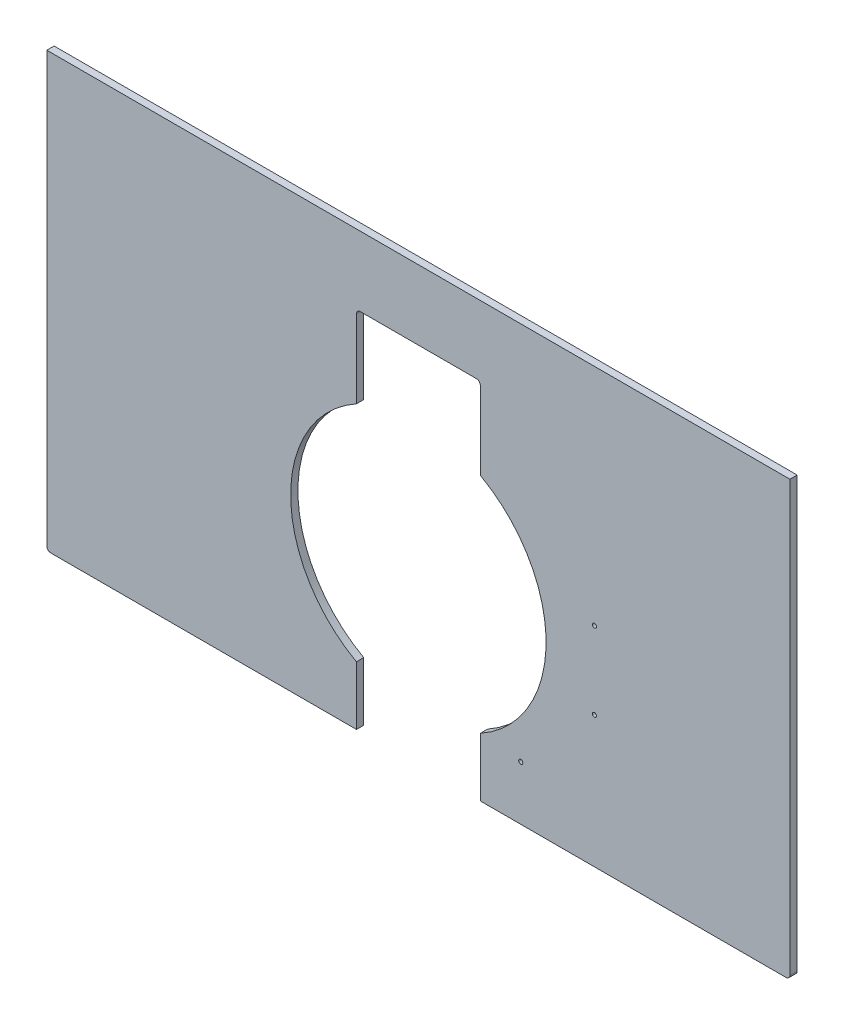
ISO-10303-21;
HEADER;
FILE_DESCRIPTION(('STEP AP214'),'2;1');
FILE_NAME('part.step','',(''),(''),'','','');
FILE_SCHEMA(('AUTOMOTIVE_DESIGN { 1 0 10303 214 1 1 1 1 }'));
ENDSEC;
DATA;
#1=APPLICATION_CONTEXT('core data for automotive mechanical design processes');
#2=APPLICATION_PROTOCOL_DEFINITION('international standard','automotive_design',2000,#1);
#3=PRODUCT_CONTEXT('',#1,'mechanical');
#4=PRODUCT('Part','Part','',(#3));
#5=PRODUCT_RELATED_PRODUCT_CATEGORY('part','',(#4));
#6=PRODUCT_DEFINITION_FORMATION('','',#4);
#7=PRODUCT_DEFINITION_CONTEXT('part definition',#1,'design');
#8=PRODUCT_DEFINITION('design','',#6,#7);
#9=PRODUCT_DEFINITION_SHAPE('','',#8);
#10=(LENGTH_UNIT() NAMED_UNIT(*) SI_UNIT(.MILLI.,.METRE.));
#11=(NAMED_UNIT(*) PLANE_ANGLE_UNIT() SI_UNIT($,.RADIAN.));
#12=(NAMED_UNIT(*) SI_UNIT($,.STERADIAN.) SOLID_ANGLE_UNIT());
#13=UNCERTAINTY_MEASURE_WITH_UNIT(LENGTH_MEASURE(1.E-05),#10,'distance_accuracy_value','');
#14=(GEOMETRIC_REPRESENTATION_CONTEXT(3) GLOBAL_UNCERTAINTY_ASSIGNED_CONTEXT((#13)) GLOBAL_UNIT_ASSIGNED_CONTEXT((#10,
#11,#12)) REPRESENTATION_CONTEXT('',''));
#15=CARTESIAN_POINT('',(0.,0.,0.));
#16=DIRECTION('',(0.,0.,1.));
#17=DIRECTION('',(1.,0.,0.));
#18=AXIS2_PLACEMENT_3D('',#15,#16,#17);
#19=CARTESIAN_POINT('',(0.,0.,11.90625));
#20=DIRECTION('',(0.,1.,0.));
#21=DIRECTION('',(0.,0.,1.));
#22=AXIS2_PLACEMENT_3D('',#19,#20,#21);
#23=PLANE('',#22);
#24=DIRECTION('',(1.,0.,0.));
#25=VECTOR('',#24,1.);
#26=CARTESIAN_POINT('',(0.,0.,11.90625));
#27=LINE('',#26,#25);
#28=CARTESIAN_POINT('',(6.35,0.,11.90625));
#29=VERTEX_POINT('',#28);
#30=CARTESIAN_POINT('',(508.,0.,11.90625));
#31=VERTEX_POINT('',#30);
#32=EDGE_CURVE('E169',#29,#31,#27,.T.);
#33=ORIENTED_EDGE('',*,*,#32,.F.);
#34=DIRECTION('',(0.,0.,-1.));
#35=VECTOR('',#34,1.);
#36=CARTESIAN_POINT('',(6.35,0.,11.90625));
#37=LINE('',#36,#35);
#38=CARTESIAN_POINT('',(6.35,0.,0.));
#39=VERTEX_POINT('',#38);
#40=EDGE_CURVE('E190',#29,#39,#37,.T.);
#41=ORIENTED_EDGE('',*,*,#40,.T.);
#42=DIRECTION('',(1.,0.,0.));
#43=VECTOR('',#42,1.);
#44=CARTESIAN_POINT('',(0.,0.,0.));
#45=LINE('',#44,#43);
#46=CARTESIAN_POINT('',(508.,0.,0.));
#47=VERTEX_POINT('',#46);
#48=EDGE_CURVE('E173',#39,#47,#45,.T.);
#49=ORIENTED_EDGE('',*,*,#48,.T.);
#50=DIRECTION('',(0.,0.,1.));
#51=VECTOR('',#50,1.);
#52=CARTESIAN_POINT('',(508.,0.,11.90625));
#53=LINE('',#52,#51);
#54=EDGE_CURVE('E260',#47,#31,#53,.T.);
#55=ORIENTED_EDGE('',*,*,#54,.T.);
#56=EDGE_LOOP('',(#33,#41,#49,#55));
#57=FACE_BOUND('',#56,.T.);
#58=ADVANCED_FACE('F35',(#57),#23,.F.);
#59=CARTESIAN_POINT('',(609.6,279.4,0.));
#60=DIRECTION('',(0.,0.,1.));
#61=DIRECTION('',(1.,0.,0.));
#62=AXIS2_PLACEMENT_3D('',#59,#60,#61);
#63=CYLINDRICAL_SURFACE('',#62,209.55);
#64=CARTESIAN_POINT('',(609.6,279.4,11.90625));
#65=DIRECTION('',(0.,0.,1.));
#66=DIRECTION('',(1.,0.,0.));
#67=AXIS2_PLACEMENT_3D('',#64,#65,#66);
#68=CIRCLE('',#67,209.55);
#69=CARTESIAN_POINT('',(508.,462.672045058705,11.90625));
#70=VERTEX_POINT('',#69);
#71=CARTESIAN_POINT('',(508.,96.127954941295,11.90625));
#72=VERTEX_POINT('',#71);
#73=EDGE_CURVE('E268',#70,#72,#68,.T.);
#74=ORIENTED_EDGE('',*,*,#73,.T.);
#75=DIRECTION('',(0.,0.,1.));
#76=VECTOR('',#75,1.);
#77=CARTESIAN_POINT('',(508.,96.127954941295,0.));
#78=LINE('',#77,#76);
#79=CARTESIAN_POINT('',(508.,96.127954941295,0.));
#80=VERTEX_POINT('',#79);
#81=EDGE_CURVE('E187',#72,#80,#78,.F.);
#82=ORIENTED_EDGE('',*,*,#81,.T.);
#83=CARTESIAN_POINT('',(609.6,279.4,0.));
#84=DIRECTION('',(0.,0.,1.));
#85=DIRECTION('',(1.,0.,0.));
#86=AXIS2_PLACEMENT_3D('',#83,#84,#85);
#87=CIRCLE('',#86,209.55);
#88=CARTESIAN_POINT('',(508.,462.672045058705,0.));
#89=VERTEX_POINT('',#88);
#90=EDGE_CURVE('E267',#89,#80,#87,.T.);
#91=ORIENTED_EDGE('',*,*,#90,.F.);
#92=DIRECTION('',(0.,0.,1.));
#93=VECTOR('',#92,1.);
#94=CARTESIAN_POINT('',(508.,462.672045058705,0.));
#95=LINE('',#94,#93);
#96=EDGE_CURVE('E167',#89,#70,#95,.T.);
#97=ORIENTED_EDGE('',*,*,#96,.T.);
#98=EDGE_LOOP('',(#74,#82,#91,#97));
#99=FACE_BOUND('',#98,.T.);
#100=ADVANCED_FACE('F324',(#99),#63,.F.);
#101=CARTESIAN_POINT('',(0.,0.,11.90625));
#102=DIRECTION('',(0.,0.,1.));
#103=DIRECTION('',(1.,0.,0.));
#104=AXIS2_PLACEMENT_3D('',#101,#102,#103);
#105=PLANE('',#104);
#106=DIRECTION('',(1.,0.,0.));
#107=VECTOR('',#106,1.);
#108=CARTESIAN_POINT('',(0.,711.2,11.90625));
#109=LINE('',#108,#107);
#110=CARTESIAN_POINT('',(0.,711.2,11.90625));
#111=VERTEX_POINT('',#110);
#112=CARTESIAN_POINT('',(1219.2,711.2,11.90625));
#113=VERTEX_POINT('',#112);
#114=EDGE_CURVE('E148',#111,#113,#109,.T.);
#115=ORIENTED_EDGE('',*,*,#114,.F.);
#116=DIRECTION('',(0.,-1.,0.));
#117=VECTOR('',#116,1.);
#118=CARTESIAN_POINT('',(0.,0.,11.90625));
#119=LINE('',#118,#117);
#120=CARTESIAN_POINT('',(0.,6.35,11.90625));
#121=VERTEX_POINT('',#120);
#122=EDGE_CURVE('E155',#111,#121,#119,.T.);
#123=ORIENTED_EDGE('',*,*,#122,.T.);
#124=CARTESIAN_POINT('',(6.35,6.35,11.90625));
#125=DIRECTION('',(0.,0.,1.));
#126=DIRECTION('',(1.,0.,0.));
#127=AXIS2_PLACEMENT_3D('',#124,#125,#126);
#128=CIRCLE('',#127,6.35);
#129=EDGE_CURVE('E200',#121,#29,#128,.T.);
#130=ORIENTED_EDGE('',*,*,#129,.T.);
#131=ORIENTED_EDGE('',*,*,#32,.T.);
#132=DIRECTION('',(0.,-1.,0.));
#133=VECTOR('',#132,1.);
#134=CARTESIAN_POINT('',(508.,127.,11.90625));
#135=LINE('',#134,#133);
#136=EDGE_CURVE('E240',#72,#31,#135,.T.);
#137=ORIENTED_EDGE('',*,*,#136,.F.);
#138=ORIENTED_EDGE('',*,*,#73,.F.);
#139=DIRECTION('',(0.,-1.,0.));
#140=VECTOR('',#139,1.);
#141=CARTESIAN_POINT('',(508.,596.9,11.90625));
#142=LINE('',#141,#140);
#143=CARTESIAN_POINT('',(508.,590.55,11.90625));
#144=VERTEX_POINT('',#143);
#145=EDGE_CURVE('E250',#144,#70,#142,.T.);
#146=ORIENTED_EDGE('',*,*,#145,.F.);
#147=CARTESIAN_POINT('',(514.35,590.55,11.90625));
#148=DIRECTION('',(0.,0.,1.));
#149=DIRECTION('',(1.,0.,0.));
#150=AXIS2_PLACEMENT_3D('',#147,#148,#149);
#151=CIRCLE('',#150,6.35);
#152=CARTESIAN_POINT('',(514.35,596.9,11.90625));
#153=VERTEX_POINT('',#152);
#154=EDGE_CURVE('E217',#144,#153,#151,.F.);
#155=ORIENTED_EDGE('',*,*,#154,.T.);
#156=DIRECTION('',(-1.,0.,0.));
#157=VECTOR('',#156,1.);
#158=CARTESIAN_POINT('',(508.,596.9,11.90625));
#159=LINE('',#158,#157);
#160=CARTESIAN_POINT('',(704.85,596.9,11.90625));
#161=VERTEX_POINT('',#160);
#162=EDGE_CURVE('E247',#161,#153,#159,.T.);
#163=ORIENTED_EDGE('',*,*,#162,.F.);
#164=CARTESIAN_POINT('',(704.85,590.55,11.90625));
#165=DIRECTION('',(0.,0.,1.));
#166=DIRECTION('',(1.,0.,0.));
#167=AXIS2_PLACEMENT_3D('',#164,#165,#166);
#168=CIRCLE('',#167,6.35);
#169=CARTESIAN_POINT('',(711.2,590.55,11.90625));
#170=VERTEX_POINT('',#169);
#171=EDGE_CURVE('E221',#161,#170,#168,.F.);
#172=ORIENTED_EDGE('',*,*,#171,.T.);
#173=DIRECTION('',(0.,1.,0.));
#174=VECTOR('',#173,1.);
#175=CARTESIAN_POINT('',(711.2,596.9,11.90625));
#176=LINE('',#175,#174);
#177=CARTESIAN_POINT('',(711.2,462.672045058705,11.90625));
#178=VERTEX_POINT('',#177);
#179=EDGE_CURVE('E245',#178,#170,#176,.T.);
#180=ORIENTED_EDGE('',*,*,#179,.F.);
#181=CARTESIAN_POINT('',(711.2,96.1279549412949,11.90625));
#182=VERTEX_POINT('',#181);
#183=EDGE_CURVE('E264',#182,#178,#68,.T.);
#184=ORIENTED_EDGE('',*,*,#183,.F.);
#185=DIRECTION('',(0.,1.,0.));
#186=VECTOR('',#185,1.);
#187=CARTESIAN_POINT('',(711.2,127.,11.90625));
#188=LINE('',#187,#186);
#189=CARTESIAN_POINT('',(711.2,0.,11.90625));
#190=VERTEX_POINT('',#189);
#191=EDGE_CURVE('E274',#190,#182,#188,.T.);
#192=ORIENTED_EDGE('',*,*,#191,.F.);
#193=CARTESIAN_POINT('',(1212.85,0.,11.90625));
#194=VERTEX_POINT('',#193);
#195=EDGE_CURVE('E180',#190,#194,#27,.T.);
#196=ORIENTED_EDGE('',*,*,#195,.T.);
#197=CARTESIAN_POINT('',(1212.85,6.35,11.90625));
#198=DIRECTION('',(0.,0.,1.));
#199=DIRECTION('',(1.,0.,0.));
#200=AXIS2_PLACEMENT_3D('',#197,#198,#199);
#201=CIRCLE('',#200,6.35);
#202=CARTESIAN_POINT('',(1219.2,6.35,11.90625));
#203=VERTEX_POINT('',#202);
#204=EDGE_CURVE('E57',#194,#203,#201,.T.);
#205=ORIENTED_EDGE('',*,*,#204,.T.);
#206=DIRECTION('',(0.,1.,0.));
#207=VECTOR('',#206,1.);
#208=CARTESIAN_POINT('',(1219.2,0.,11.90625));
#209=LINE('',#208,#207);
#210=EDGE_CURVE('E157',#203,#113,#209,.T.);
#211=ORIENTED_EDGE('',*,*,#210,.T.);
#212=EDGE_LOOP('',(#115,#123,#130,#131,#137,#138,#146,#155,#163,#172,#180,#184,#192,#196,#205,#211));
#213=FACE_BOUND('',#212,.T.);
#214=CARTESIAN_POINT('',(898.525,342.9,11.90625));
#215=DIRECTION('',(0.,0.,1.));
#216=DIRECTION('',(1.,0.,0.));
#217=AXIS2_PLACEMENT_3D('',#214,#215,#216);
#218=CIRCLE('',#217,3.37819999999999);
#219=CARTESIAN_POINT('',(901.9032,342.9,11.90625));
#220=VERTEX_POINT('',#219);
#221=EDGE_CURVE('E294',#220,#220,#218,.T.);
#222=ORIENTED_EDGE('',*,*,#221,.F.);
#223=EDGE_LOOP('',(#222));
#224=FACE_BOUND('',#223,.T.);
#225=CARTESIAN_POINT('',(898.525,215.9,11.90625));
#226=DIRECTION('',(0.,0.,1.));
#227=DIRECTION('',(1.,0.,0.));
#228=AXIS2_PLACEMENT_3D('',#225,#226,#227);
#229=CIRCLE('',#228,3.37819999999999);
#230=CARTESIAN_POINT('',(901.9032,215.9,11.90625));
#231=VERTEX_POINT('',#230);
#232=EDGE_CURVE('E297',#231,#231,#229,.T.);
#233=ORIENTED_EDGE('',*,*,#232,.F.);
#234=EDGE_LOOP('',(#233));
#235=FACE_BOUND('',#234,.T.);
#236=CARTESIAN_POINT('',(777.605208252602,88.9,11.90625));
#237=DIRECTION('',(0.,0.,1.));
#238=DIRECTION('',(1.,0.,0.));
#239=AXIS2_PLACEMENT_3D('',#236,#237,#238);
#240=CIRCLE('',#239,3.37819999999999);
#241=CARTESIAN_POINT('',(780.983408252602,88.9,11.90625));
#242=VERTEX_POINT('',#241);
#243=EDGE_CURVE('E288',#242,#242,#240,.T.);
#244=ORIENTED_EDGE('',*,*,#243,.F.);
#245=EDGE_LOOP('',(#244));
#246=FACE_BOUND('',#245,.T.);
#247=ADVANCED_FACE('F153',(#213,#224,#235,#246),#105,.T.);
#248=CARTESIAN_POINT('',(0.,0.,0.));
#249=DIRECTION('',(0.,0.,1.));
#250=DIRECTION('',(1.,0.,0.));
#251=AXIS2_PLACEMENT_3D('',#248,#249,#250);
#252=PLANE('',#251);
#253=CARTESIAN_POINT('',(898.525,342.9,0.));
#254=DIRECTION('',(0.,0.,1.));
#255=DIRECTION('',(1.,0.,0.));
#256=AXIS2_PLACEMENT_3D('',#253,#254,#255);
#257=CIRCLE('',#256,3.37819999999999);
#258=CARTESIAN_POINT('',(901.9032,342.9,0.));
#259=VERTEX_POINT('',#258);
#260=EDGE_CURVE('E254',#259,#259,#257,.T.);
#261=ORIENTED_EDGE('',*,*,#260,.T.);
#262=EDGE_LOOP('',(#261));
#263=FACE_BOUND('',#262,.T.);
#264=CARTESIAN_POINT('',(898.525,215.9,0.));
#265=DIRECTION('',(0.,0.,1.));
#266=DIRECTION('',(1.,0.,0.));
#267=AXIS2_PLACEMENT_3D('',#264,#265,#266);
#268=CIRCLE('',#267,3.37819999999999);
#269=CARTESIAN_POINT('',(901.9032,215.9,0.));
#270=VERTEX_POINT('',#269);
#271=EDGE_CURVE('E300',#270,#270,#268,.T.);
#272=ORIENTED_EDGE('',*,*,#271,.T.);
#273=EDGE_LOOP('',(#272));
#274=FACE_BOUND('',#273,.T.);
#275=CARTESIAN_POINT('',(777.605208252602,88.9,0.));
#276=DIRECTION('',(0.,0.,1.));
#277=DIRECTION('',(1.,0.,0.));
#278=AXIS2_PLACEMENT_3D('',#275,#276,#277);
#279=CIRCLE('',#278,3.37819999999999);
#280=CARTESIAN_POINT('',(780.983408252602,88.9,0.));
#281=VERTEX_POINT('',#280);
#282=EDGE_CURVE('E285',#281,#281,#279,.T.);
#283=ORIENTED_EDGE('',*,*,#282,.T.);
#284=EDGE_LOOP('',(#283));
#285=FACE_BOUND('',#284,.T.);
#286=DIRECTION('',(0.,-1.,0.));
#287=VECTOR('',#286,1.);
#288=CARTESIAN_POINT('',(0.,0.,0.));
#289=LINE('',#288,#287);
#290=CARTESIAN_POINT('',(0.,711.2,0.));
#291=VERTEX_POINT('',#290);
#292=CARTESIAN_POINT('',(0.,6.35,0.));
#293=VERTEX_POINT('',#292);
#294=EDGE_CURVE('E179',#291,#293,#289,.T.);
#295=ORIENTED_EDGE('',*,*,#294,.F.);
#296=DIRECTION('',(1.,0.,0.));
#297=VECTOR('',#296,1.);
#298=CARTESIAN_POINT('',(0.,711.2,0.));
#299=LINE('',#298,#297);
#300=CARTESIAN_POINT('',(1219.2,711.2,0.));
#301=VERTEX_POINT('',#300);
#302=EDGE_CURVE('E50',#291,#301,#299,.T.);
#303=ORIENTED_EDGE('',*,*,#302,.T.);
#304=DIRECTION('',(0.,1.,0.));
#305=VECTOR('',#304,1.);
#306=CARTESIAN_POINT('',(1219.2,0.,0.));
#307=LINE('',#306,#305);
#308=CARTESIAN_POINT('',(1219.2,6.35,0.));
#309=VERTEX_POINT('',#308);
#310=EDGE_CURVE('E175',#309,#301,#307,.T.);
#311=ORIENTED_EDGE('',*,*,#310,.F.);
#312=CARTESIAN_POINT('',(1212.85,6.35,0.));
#313=DIRECTION('',(0.,0.,1.));
#314=DIRECTION('',(1.,0.,0.));
#315=AXIS2_PLACEMENT_3D('',#312,#313,#314);
#316=CIRCLE('',#315,6.35);
#317=CARTESIAN_POINT('',(1212.85,0.,0.));
#318=VERTEX_POINT('',#317);
#319=EDGE_CURVE('E193',#309,#318,#316,.F.);
#320=ORIENTED_EDGE('',*,*,#319,.T.);
#321=CARTESIAN_POINT('',(711.2,0.,0.));
#322=VERTEX_POINT('',#321);
#323=EDGE_CURVE('E176',#322,#318,#45,.T.);
#324=ORIENTED_EDGE('',*,*,#323,.F.);
#325=DIRECTION('',(0.,1.,0.));
#326=VECTOR('',#325,1.);
#327=CARTESIAN_POINT('',(711.2,127.,0.));
#328=LINE('',#327,#326);
#329=CARTESIAN_POINT('',(711.2,96.1279549412949,0.));
#330=VERTEX_POINT('',#329);
#331=EDGE_CURVE('E261',#322,#330,#328,.T.);
#332=ORIENTED_EDGE('',*,*,#331,.T.);
#333=CARTESIAN_POINT('',(711.2,462.672045058705,0.));
#334=VERTEX_POINT('',#333);
#335=EDGE_CURVE('E265',#330,#334,#87,.T.);
#336=ORIENTED_EDGE('',*,*,#335,.T.);
#337=DIRECTION('',(0.,1.,0.));
#338=VECTOR('',#337,1.);
#339=CARTESIAN_POINT('',(711.2,596.9,0.));
#340=LINE('',#339,#338);
#341=CARTESIAN_POINT('',(711.2,590.55,0.));
#342=VERTEX_POINT('',#341);
#343=EDGE_CURVE('E231',#334,#342,#340,.T.);
#344=ORIENTED_EDGE('',*,*,#343,.T.);
#345=CARTESIAN_POINT('',(704.85,590.55,0.));
#346=DIRECTION('',(0.,0.,1.));
#347=DIRECTION('',(1.,0.,0.));
#348=AXIS2_PLACEMENT_3D('',#345,#346,#347);
#349=CIRCLE('',#348,6.35);
#350=CARTESIAN_POINT('',(704.85,596.9,0.));
#351=VERTEX_POINT('',#350);
#352=EDGE_CURVE('E43',#342,#351,#349,.T.);
#353=ORIENTED_EDGE('',*,*,#352,.T.);
#354=DIRECTION('',(-1.,0.,0.));
#355=VECTOR('',#354,1.);
#356=CARTESIAN_POINT('',(508.,596.9,0.));
#357=LINE('',#356,#355);
#358=CARTESIAN_POINT('',(514.35,596.9,0.));
#359=VERTEX_POINT('',#358);
#360=EDGE_CURVE('E228',#351,#359,#357,.T.);
#361=ORIENTED_EDGE('',*,*,#360,.T.);
#362=CARTESIAN_POINT('',(514.35,590.55,0.));
#363=DIRECTION('',(0.,0.,1.));
#364=DIRECTION('',(1.,0.,0.));
#365=AXIS2_PLACEMENT_3D('',#362,#363,#364);
#366=CIRCLE('',#365,6.35);
#367=CARTESIAN_POINT('',(508.,590.55,0.));
#368=VERTEX_POINT('',#367);
#369=EDGE_CURVE('E219',#359,#368,#366,.T.);
#370=ORIENTED_EDGE('',*,*,#369,.T.);
#371=DIRECTION('',(0.,-1.,0.));
#372=VECTOR('',#371,1.);
#373=CARTESIAN_POINT('',(508.,596.9,0.));
#374=LINE('',#373,#372);
#375=EDGE_CURVE('E252',#368,#89,#374,.T.);
#376=ORIENTED_EDGE('',*,*,#375,.T.);
#377=ORIENTED_EDGE('',*,*,#90,.T.);
#378=DIRECTION('',(0.,-1.,0.));
#379=VECTOR('',#378,1.);
#380=CARTESIAN_POINT('',(508.,127.,0.));
#381=LINE('',#380,#379);
#382=EDGE_CURVE('E305',#80,#47,#381,.T.);
#383=ORIENTED_EDGE('',*,*,#382,.T.);
#384=ORIENTED_EDGE('',*,*,#48,.F.);
#385=CARTESIAN_POINT('',(6.35,6.35,0.));
#386=DIRECTION('',(0.,0.,1.));
#387=DIRECTION('',(1.,0.,0.));
#388=AXIS2_PLACEMENT_3D('',#385,#386,#387);
#389=CIRCLE('',#388,6.35);
#390=EDGE_CURVE('E195',#39,#293,#389,.F.);
#391=ORIENTED_EDGE('',*,*,#390,.T.);
#392=EDGE_LOOP('',(#295,#303,#311,#320,#324,#332,#336,#344,#353,#361,#370,#376,#377,#383,#384,#391));
#393=FACE_BOUND('',#392,.T.);
#394=ADVANCED_FACE('F227',(#263,#274,#285,#393),#252,.F.);
#395=ORIENTED_EDGE('',*,*,#323,.T.);
#396=DIRECTION('',(0.,0.,-1.));
#397=VECTOR('',#396,1.);
#398=CARTESIAN_POINT('',(1212.85,0.,11.90625));
#399=LINE('',#398,#397);
#400=EDGE_CURVE('E205',#318,#194,#399,.F.);
#401=ORIENTED_EDGE('',*,*,#400,.T.);
#402=ORIENTED_EDGE('',*,*,#195,.F.);
#403=DIRECTION('',(0.,0.,-1.));
#404=VECTOR('',#403,1.);
#405=CARTESIAN_POINT('',(711.2,0.,11.90625));
#406=LINE('',#405,#404);
#407=EDGE_CURVE('E257',#190,#322,#406,.T.);
#408=ORIENTED_EDGE('',*,*,#407,.T.);
#409=EDGE_LOOP('',(#395,#401,#402,#408));
#410=FACE_BOUND('',#409,.T.);
#411=ADVANCED_FACE('F325',(#410),#23,.F.);
#412=CARTESIAN_POINT('',(1219.2,0.,11.90625));
#413=DIRECTION('',(-1.,0.,0.));
#414=DIRECTION('',(0.,0.,1.));
#415=AXIS2_PLACEMENT_3D('',#412,#413,#414);
#416=PLANE('',#415);
#417=ORIENTED_EDGE('',*,*,#310,.T.);
#418=DIRECTION('',(0.,0.,1.));
#419=VECTOR('',#418,1.);
#420=CARTESIAN_POINT('',(1219.2,711.2,-0.793749999999999));
#421=LINE('',#420,#419);
#422=EDGE_CURVE('E158',#301,#113,#421,.T.);
#423=ORIENTED_EDGE('',*,*,#422,.T.);
#424=ORIENTED_EDGE('',*,*,#210,.F.);
#425=DIRECTION('',(0.,0.,-1.));
#426=VECTOR('',#425,1.);
#427=CARTESIAN_POINT('',(1219.2,6.35,11.90625));
#428=LINE('',#427,#426);
#429=EDGE_CURVE('E202',#203,#309,#428,.T.);
#430=ORIENTED_EDGE('',*,*,#429,.T.);
#431=EDGE_LOOP('',(#417,#423,#424,#430));
#432=FACE_BOUND('',#431,.T.);
#433=ADVANCED_FACE('F282',(#432),#416,.F.);
#434=CARTESIAN_POINT('',(0.,0.,11.90625));
#435=DIRECTION('',(1.,0.,0.));
#436=DIRECTION('',(0.,0.,-1.));
#437=AXIS2_PLACEMENT_3D('',#434,#435,#436);
#438=PLANE('',#437);
#439=ORIENTED_EDGE('',*,*,#122,.F.);
#440=DIRECTION('',(0.,0.,-1.));
#441=VECTOR('',#440,1.);
#442=CARTESIAN_POINT('',(0.,711.2,11.90625));
#443=LINE('',#442,#441);
#444=EDGE_CURVE('E11',#111,#291,#443,.T.);
#445=ORIENTED_EDGE('',*,*,#444,.T.);
#446=ORIENTED_EDGE('',*,*,#294,.T.);
#447=DIRECTION('',(0.,0.,-1.));
#448=VECTOR('',#447,1.);
#449=CARTESIAN_POINT('',(0.,6.35,11.90625));
#450=LINE('',#449,#448);
#451=EDGE_CURVE('E162',#293,#121,#450,.F.);
#452=ORIENTED_EDGE('',*,*,#451,.T.);
#453=EDGE_LOOP('',(#439,#445,#446,#452));
#454=FACE_BOUND('',#453,.T.);
#455=ADVANCED_FACE('F160',(#454),#438,.F.);
#456=ORIENTED_EDGE('',*,*,#335,.F.);
#457=DIRECTION('',(0.,0.,1.));
#458=VECTOR('',#457,1.);
#459=CARTESIAN_POINT('',(711.2,96.1279549412949,0.));
#460=LINE('',#459,#458);
#461=EDGE_CURVE('E184',#330,#182,#460,.T.);
#462=ORIENTED_EDGE('',*,*,#461,.T.);
#463=ORIENTED_EDGE('',*,*,#183,.T.);
#464=DIRECTION('',(0.,0.,1.));
#465=VECTOR('',#464,1.);
#466=CARTESIAN_POINT('',(711.2,462.672045058705,0.));
#467=LINE('',#466,#465);
#468=EDGE_CURVE('E164',#178,#334,#467,.F.);
#469=ORIENTED_EDGE('',*,*,#468,.T.);
#470=EDGE_LOOP('',(#456,#462,#463,#469));
#471=FACE_BOUND('',#470,.T.);
#472=ADVANCED_FACE('F329',(#471),#63,.F.);
#473=CARTESIAN_POINT('',(508.,596.9,0.));
#474=DIRECTION('',(-1.,0.,0.));
#475=DIRECTION('',(0.,0.,1.));
#476=AXIS2_PLACEMENT_3D('',#473,#474,#475);
#477=PLANE('',#476);
#478=ORIENTED_EDGE('',*,*,#375,.F.);
#479=DIRECTION('',(0.,0.,1.));
#480=VECTOR('',#479,1.);
#481=CARTESIAN_POINT('',(508.,590.55,11.90625));
#482=LINE('',#481,#480);
#483=EDGE_CURVE('E207',#368,#144,#482,.T.);
#484=ORIENTED_EDGE('',*,*,#483,.T.);
#485=ORIENTED_EDGE('',*,*,#145,.T.);
#486=ORIENTED_EDGE('',*,*,#96,.F.);
#487=EDGE_LOOP('',(#478,#484,#485,#486));
#488=FACE_BOUND('',#487,.T.);
#489=ADVANCED_FACE('F319',(#488),#477,.F.);
#490=CARTESIAN_POINT('',(711.2,596.9,0.));
#491=DIRECTION('',(1.,0.,0.));
#492=DIRECTION('',(0.,0.,-1.));
#493=AXIS2_PLACEMENT_3D('',#490,#491,#492);
#494=PLANE('',#493);
#495=ORIENTED_EDGE('',*,*,#179,.T.);
#496=DIRECTION('',(0.,0.,1.));
#497=VECTOR('',#496,1.);
#498=CARTESIAN_POINT('',(711.2,590.55,0.));
#499=LINE('',#498,#497);
#500=EDGE_CURVE('E215',#170,#342,#499,.F.);
#501=ORIENTED_EDGE('',*,*,#500,.T.);
#502=ORIENTED_EDGE('',*,*,#343,.F.);
#503=ORIENTED_EDGE('',*,*,#468,.F.);
#504=EDGE_LOOP('',(#495,#501,#502,#503));
#505=FACE_BOUND('',#504,.T.);
#506=ADVANCED_FACE('F249',(#505),#494,.F.);
#507=CARTESIAN_POINT('',(508.,596.9,0.));
#508=DIRECTION('',(0.,1.,0.));
#509=DIRECTION('',(0.,0.,1.));
#510=AXIS2_PLACEMENT_3D('',#507,#508,#509);
#511=PLANE('',#510);
#512=ORIENTED_EDGE('',*,*,#162,.T.);
#513=DIRECTION('',(0.,0.,1.));
#514=VECTOR('',#513,1.);
#515=CARTESIAN_POINT('',(514.35,596.9,0.));
#516=LINE('',#515,#514);
#517=EDGE_CURVE('E213',#153,#359,#516,.F.);
#518=ORIENTED_EDGE('',*,*,#517,.T.);
#519=ORIENTED_EDGE('',*,*,#360,.F.);
#520=DIRECTION('',(0.,0.,1.));
#521=VECTOR('',#520,1.);
#522=CARTESIAN_POINT('',(704.85,596.9,11.90625));
#523=LINE('',#522,#521);
#524=EDGE_CURVE('E210',#351,#161,#523,.T.);
#525=ORIENTED_EDGE('',*,*,#524,.T.);
#526=EDGE_LOOP('',(#512,#518,#519,#525));
#527=FACE_BOUND('',#526,.T.);
#528=ADVANCED_FACE('F237',(#527),#511,.F.);
#529=CARTESIAN_POINT('',(711.2,127.,0.));
#530=DIRECTION('',(1.,0.,0.));
#531=DIRECTION('',(0.,0.,-1.));
#532=AXIS2_PLACEMENT_3D('',#529,#530,#531);
#533=PLANE('',#532);
#534=ORIENTED_EDGE('',*,*,#191,.T.);
#535=ORIENTED_EDGE('',*,*,#461,.F.);
#536=ORIENTED_EDGE('',*,*,#331,.F.);
#537=ORIENTED_EDGE('',*,*,#407,.F.);
#538=EDGE_LOOP('',(#534,#535,#536,#537));
#539=FACE_BOUND('',#538,.T.);
#540=ADVANCED_FACE('F330',(#539),#533,.F.);
#541=CARTESIAN_POINT('',(508.,127.,0.));
#542=DIRECTION('',(-1.,0.,0.));
#543=DIRECTION('',(0.,0.,1.));
#544=AXIS2_PLACEMENT_3D('',#541,#542,#543);
#545=PLANE('',#544);
#546=ORIENTED_EDGE('',*,*,#382,.F.);
#547=ORIENTED_EDGE('',*,*,#81,.F.);
#548=ORIENTED_EDGE('',*,*,#136,.T.);
#549=ORIENTED_EDGE('',*,*,#54,.F.);
#550=EDGE_LOOP('',(#546,#547,#548,#549));
#551=FACE_BOUND('',#550,.T.);
#552=ADVANCED_FACE('F332',(#551),#545,.F.);
#553=CARTESIAN_POINT('',(777.605208252602,88.9,0.));
#554=DIRECTION('',(0.,0.,1.));
#555=DIRECTION('',(1.,0.,0.));
#556=AXIS2_PLACEMENT_3D('',#553,#554,#555);
#557=CYLINDRICAL_SURFACE('',#556,3.37819999999999);
#558=ORIENTED_EDGE('',*,*,#282,.F.);
#559=EDGE_LOOP('',(#558));
#560=FACE_BOUND('',#559,.T.);
#561=ORIENTED_EDGE('',*,*,#243,.T.);
#562=EDGE_LOOP('',(#561));
#563=FACE_BOUND('',#562,.T.);
#564=ADVANCED_FACE('F338',(#560,#563),#557,.F.);
#565=CARTESIAN_POINT('',(898.525,215.9,0.));
#566=DIRECTION('',(0.,0.,1.));
#567=DIRECTION('',(1.,0.,0.));
#568=AXIS2_PLACEMENT_3D('',#565,#566,#567);
#569=CYLINDRICAL_SURFACE('',#568,3.37819999999999);
#570=ORIENTED_EDGE('',*,*,#271,.F.);
#571=EDGE_LOOP('',(#570));
#572=FACE_BOUND('',#571,.T.);
#573=ORIENTED_EDGE('',*,*,#232,.T.);
#574=EDGE_LOOP('',(#573));
#575=FACE_BOUND('',#574,.T.);
#576=ADVANCED_FACE('F456',(#572,#575),#569,.F.);
#577=CARTESIAN_POINT('',(898.525,342.9,0.));
#578=DIRECTION('',(0.,0.,1.));
#579=DIRECTION('',(1.,0.,0.));
#580=AXIS2_PLACEMENT_3D('',#577,#578,#579);
#581=CYLINDRICAL_SURFACE('',#580,3.37819999999999);
#582=ORIENTED_EDGE('',*,*,#260,.F.);
#583=EDGE_LOOP('',(#582));
#584=FACE_BOUND('',#583,.T.);
#585=ORIENTED_EDGE('',*,*,#221,.T.);
#586=EDGE_LOOP('',(#585));
#587=FACE_BOUND('',#586,.T.);
#588=ADVANCED_FACE('F394',(#584,#587),#581,.F.);
#589=CARTESIAN_POINT('',(6.35,6.35,11.90625));
#590=DIRECTION('',(0.,0.,-1.));
#591=DIRECTION('',(-1.,0.,0.));
#592=AXIS2_PLACEMENT_3D('',#589,#590,#591);
#593=CYLINDRICAL_SURFACE('',#592,6.35);
#594=ORIENTED_EDGE('',*,*,#129,.F.);
#595=ORIENTED_EDGE('',*,*,#451,.F.);
#596=ORIENTED_EDGE('',*,*,#390,.F.);
#597=ORIENTED_EDGE('',*,*,#40,.F.);
#598=EDGE_LOOP('',(#594,#595,#596,#597));
#599=FACE_BOUND('',#598,.T.);
#600=ADVANCED_FACE('F389',(#599),#593,.T.);
#601=CARTESIAN_POINT('',(1212.85,6.35,11.90625));
#602=DIRECTION('',(0.,0.,-1.));
#603=DIRECTION('',(-1.,0.,0.));
#604=AXIS2_PLACEMENT_3D('',#601,#602,#603);
#605=CYLINDRICAL_SURFACE('',#604,6.35);
#606=ORIENTED_EDGE('',*,*,#204,.F.);
#607=ORIENTED_EDGE('',*,*,#400,.F.);
#608=ORIENTED_EDGE('',*,*,#319,.F.);
#609=ORIENTED_EDGE('',*,*,#429,.F.);
#610=EDGE_LOOP('',(#606,#607,#608,#609));
#611=FACE_BOUND('',#610,.T.);
#612=ADVANCED_FACE('F279',(#611),#605,.T.);
#613=CARTESIAN_POINT('',(514.35,590.55,0.));
#614=DIRECTION('',(0.,0.,-1.));
#615=DIRECTION('',(-1.,0.,0.));
#616=AXIS2_PLACEMENT_3D('',#613,#614,#615);
#617=CYLINDRICAL_SURFACE('',#616,6.35);
#618=ORIENTED_EDGE('',*,*,#369,.F.);
#619=ORIENTED_EDGE('',*,*,#517,.F.);
#620=ORIENTED_EDGE('',*,*,#154,.F.);
#621=ORIENTED_EDGE('',*,*,#483,.F.);
#622=EDGE_LOOP('',(#618,#619,#620,#621));
#623=FACE_BOUND('',#622,.T.);
#624=ADVANCED_FACE('F405',(#623),#617,.F.);
#625=CARTESIAN_POINT('',(704.85,590.55,0.));
#626=DIRECTION('',(0.,0.,-1.));
#627=DIRECTION('',(-1.,0.,0.));
#628=AXIS2_PLACEMENT_3D('',#625,#626,#627);
#629=CYLINDRICAL_SURFACE('',#628,6.35);
#630=ORIENTED_EDGE('',*,*,#352,.F.);
#631=ORIENTED_EDGE('',*,*,#500,.F.);
#632=ORIENTED_EDGE('',*,*,#171,.F.);
#633=ORIENTED_EDGE('',*,*,#524,.F.);
#634=EDGE_LOOP('',(#630,#631,#632,#633));
#635=FACE_BOUND('',#634,.T.);
#636=ADVANCED_FACE('F37',(#635),#629,.F.);
#637=CARTESIAN_POINT('',(0.,711.2,-0.793749999999999));
#638=DIRECTION('',(0.,-1.,0.));
#639=DIRECTION('',(1.,0.,0.));
#640=AXIS2_PLACEMENT_3D('',#637,#638,#639);
#641=PLANE('',#640);
#642=ORIENTED_EDGE('',*,*,#444,.F.);
#643=ORIENTED_EDGE('',*,*,#114,.T.);
#644=ORIENTED_EDGE('',*,*,#422,.F.);
#645=ORIENTED_EDGE('',*,*,#302,.F.);
#646=EDGE_LOOP('',(#642,#643,#644,#645));
#647=FACE_BOUND('',#646,.T.);
#648=ADVANCED_FACE('F147',(#647),#641,.F.);
#649=CLOSED_SHELL('',(#58,#100,#247,#394,#411,#433,#455,#472,#489,#506,#528,#540,#552,#564,#576,
#588,#600,#612,#624,#636,#648));
#650=MANIFOLD_SOLID_BREP('B2',#649);
#651=ADVANCED_BREP_SHAPE_REPRESENTATION('',(#18,#650),#14);
#652=SHAPE_DEFINITION_REPRESENTATION(#9,#651);
ENDSEC;
END-ISO-10303-21;
